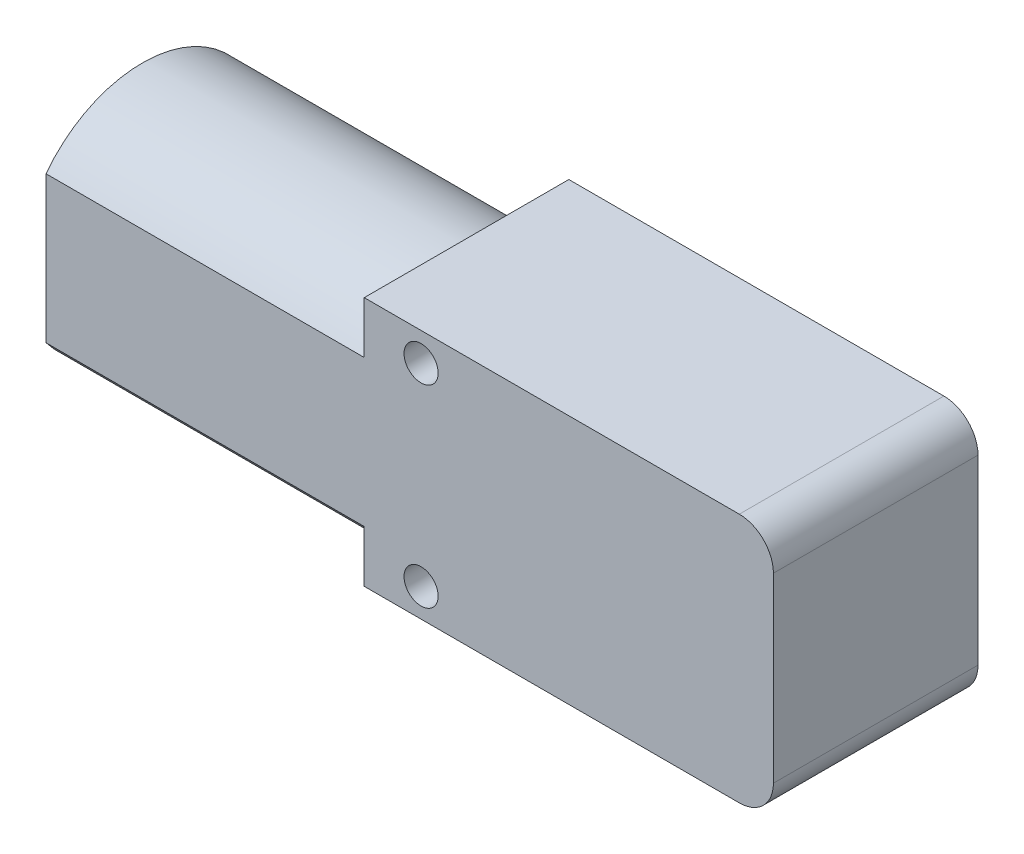
ISO-10303-21;
HEADER;
FILE_DESCRIPTION(('STEP AP214'),'2;1');
FILE_NAME('part.step','',(''),(''),'','','');
FILE_SCHEMA(('AUTOMOTIVE_DESIGN { 1 0 10303 214 1 1 1 1 }'));
ENDSEC;
DATA;
#1=APPLICATION_CONTEXT('core data for automotive mechanical design processes');
#2=APPLICATION_PROTOCOL_DEFINITION('international standard','automotive_design',2000,#1);
#3=PRODUCT_CONTEXT('',#1,'mechanical');
#4=PRODUCT('Part','Part','',(#3));
#5=PRODUCT_RELATED_PRODUCT_CATEGORY('part','',(#4));
#6=PRODUCT_DEFINITION_FORMATION('','',#4);
#7=PRODUCT_DEFINITION_CONTEXT('part definition',#1,'design');
#8=PRODUCT_DEFINITION('design','',#6,#7);
#9=PRODUCT_DEFINITION_SHAPE('','',#8);
#10=(LENGTH_UNIT() NAMED_UNIT(*) SI_UNIT(.MILLI.,.METRE.));
#11=(NAMED_UNIT(*) PLANE_ANGLE_UNIT() SI_UNIT($,.RADIAN.));
#12=(NAMED_UNIT(*) SI_UNIT($,.STERADIAN.) SOLID_ANGLE_UNIT());
#13=UNCERTAINTY_MEASURE_WITH_UNIT(LENGTH_MEASURE(1.E-05),#10,'distance_accuracy_value','');
#14=(GEOMETRIC_REPRESENTATION_CONTEXT(3) GLOBAL_UNCERTAINTY_ASSIGNED_CONTEXT((#13)) GLOBAL_UNIT_ASSIGNED_CONTEXT((#10,
#11,#12)) REPRESENTATION_CONTEXT('',''));
#15=CARTESIAN_POINT('',(0.,0.,0.));
#16=DIRECTION('',(0.,0.,1.));
#17=DIRECTION('',(1.,0.,0.));
#18=AXIS2_PLACEMENT_3D('',#15,#16,#17);
#19=CARTESIAN_POINT('',(0.,0.,18.));
#20=DIRECTION('',(0.,0.,-1.));
#21=DIRECTION('',(-1.,0.,0.));
#22=AXIS2_PLACEMENT_3D('',#19,#20,#21);
#23=PLANE('',#22);
#24=DIRECTION('',(1.,0.,0.));
#25=VECTOR('',#24,1.);
#26=CARTESIAN_POINT('',(18.,-11.,18.));
#27=LINE('',#26,#25);
#28=CARTESIAN_POINT('',(-18.,-11.,18.));
#29=VERTEX_POINT('',#28);
#30=CARTESIAN_POINT('',(15.,-11.,18.));
#31=VERTEX_POINT('',#30);
#32=EDGE_CURVE('E148',#29,#31,#27,.T.);
#33=ORIENTED_EDGE('',*,*,#32,.T.);
#34=CARTESIAN_POINT('',(15.,-8.00000000000001,18.));
#35=DIRECTION('',(0.,0.,-1.));
#36=DIRECTION('',(-1.,0.,0.));
#37=AXIS2_PLACEMENT_3D('',#34,#35,#36);
#38=CIRCLE('',#37,3.);
#39=CARTESIAN_POINT('',(18.,-8.00000000000001,18.));
#40=VERTEX_POINT('',#39);
#41=EDGE_CURVE('E45',#31,#40,#38,.F.);
#42=ORIENTED_EDGE('',*,*,#41,.T.);
#43=DIRECTION('',(0.,1.,0.));
#44=VECTOR('',#43,1.);
#45=CARTESIAN_POINT('',(18.,11.,18.));
#46=LINE('',#45,#44);
#47=CARTESIAN_POINT('',(18.,7.99999999999999,18.));
#48=VERTEX_POINT('',#47);
#49=EDGE_CURVE('E151',#40,#48,#46,.T.);
#50=ORIENTED_EDGE('',*,*,#49,.T.);
#51=CARTESIAN_POINT('',(15.,7.99999999999999,18.));
#52=DIRECTION('',(0.,0.,-1.));
#53=DIRECTION('',(-1.,0.,0.));
#54=AXIS2_PLACEMENT_3D('',#51,#52,#53);
#55=CIRCLE('',#54,3.);
#56=CARTESIAN_POINT('',(15.,11.,18.));
#57=VERTEX_POINT('',#56);
#58=EDGE_CURVE('E180',#48,#57,#55,.F.);
#59=ORIENTED_EDGE('',*,*,#58,.T.);
#60=DIRECTION('',(-1.,0.,0.));
#61=VECTOR('',#60,1.);
#62=CARTESIAN_POINT('',(18.,11.,18.));
#63=LINE('',#62,#61);
#64=CARTESIAN_POINT('',(-18.,11.,18.));
#65=VERTEX_POINT('',#64);
#66=EDGE_CURVE('E154',#57,#65,#63,.T.);
#67=ORIENTED_EDGE('',*,*,#66,.T.);
#68=DIRECTION('',(0.,-1.,0.));
#69=VECTOR('',#68,1.);
#70=CARTESIAN_POINT('',(-18.,11.,18.));
#71=LINE('',#70,#69);
#72=CARTESIAN_POINT('',(-18.,6.43904350909976,18.));
#73=VERTEX_POINT('',#72);
#74=EDGE_CURVE('E145',#65,#73,#71,.T.);
#75=ORIENTED_EDGE('',*,*,#74,.T.);
#76=DIRECTION('',(1.,0.,0.));
#77=VECTOR('',#76,1.);
#78=CARTESIAN_POINT('',(-46.,6.43904350909976,18.));
#79=LINE('',#78,#77);
#80=CARTESIAN_POINT('',(-46.,6.43904350909976,18.));
#81=VERTEX_POINT('',#80);
#82=EDGE_CURVE('E210',#81,#73,#79,.T.);
#83=ORIENTED_EDGE('',*,*,#82,.F.);
#84=DIRECTION('',(0.,1.,0.));
#85=VECTOR('',#84,1.);
#86=CARTESIAN_POINT('',(-46.,6.43904350909976,18.));
#87=LINE('',#86,#85);
#88=CARTESIAN_POINT('',(-46.,-6.43904350909977,18.));
#89=VERTEX_POINT('',#88);
#90=EDGE_CURVE('E128',#89,#81,#87,.T.);
#91=ORIENTED_EDGE('',*,*,#90,.F.);
#92=DIRECTION('',(1.,0.,0.));
#93=VECTOR('',#92,1.);
#94=CARTESIAN_POINT('',(-46.,-6.43904350909977,18.));
#95=LINE('',#94,#93);
#96=CARTESIAN_POINT('',(-18.,-6.43904350909976,18.));
#97=VERTEX_POINT('',#96);
#98=EDGE_CURVE('E141',#89,#97,#95,.T.);
#99=ORIENTED_EDGE('',*,*,#98,.T.);
#100=EDGE_CURVE('E58',#97,#29,#71,.T.);
#101=ORIENTED_EDGE('',*,*,#100,.T.);
#102=EDGE_LOOP('',(#33,#42,#50,#59,#67,#75,#83,#91,#99,#101));
#103=FACE_BOUND('',#102,.T.);
#104=CARTESIAN_POINT('',(-13.,-8.49999999999999,18.));
#105=DIRECTION('',(0.,0.,-1.));
#106=DIRECTION('',(-1.,0.,0.));
#107=AXIS2_PLACEMENT_3D('',#104,#105,#106);
#108=CIRCLE('',#107,1.5);
#109=CARTESIAN_POINT('',(-14.5,-8.49999999999999,18.));
#110=VERTEX_POINT('',#109);
#111=EDGE_CURVE('E229',#110,#110,#108,.F.);
#112=ORIENTED_EDGE('',*,*,#111,.F.);
#113=EDGE_LOOP('',(#112));
#114=FACE_BOUND('',#113,.T.);
#115=CARTESIAN_POINT('',(-13.,8.49999999999999,18.));
#116=DIRECTION('',(0.,0.,-1.));
#117=DIRECTION('',(-1.,0.,0.));
#118=AXIS2_PLACEMENT_3D('',#115,#116,#117);
#119=CIRCLE('',#118,1.5);
#120=CARTESIAN_POINT('',(-14.5,8.49999999999999,18.));
#121=VERTEX_POINT('',#120);
#122=EDGE_CURVE('E223',#121,#121,#119,.T.);
#123=ORIENTED_EDGE('',*,*,#122,.T.);
#124=EDGE_LOOP('',(#123));
#125=FACE_BOUND('',#124,.T.);
#126=ADVANCED_FACE('F37',(#103,#114,#125),#23,.F.);
#127=CARTESIAN_POINT('',(0.,0.,0.));
#128=DIRECTION('',(0.,0.,-1.));
#129=DIRECTION('',(-1.,0.,0.));
#130=AXIS2_PLACEMENT_3D('',#127,#128,#129);
#131=PLANE('',#130);
#132=CARTESIAN_POINT('',(-13.,-8.49999999999999,0.));
#133=DIRECTION('',(0.,0.,-1.));
#134=DIRECTION('',(-1.,0.,0.));
#135=AXIS2_PLACEMENT_3D('',#132,#133,#134);
#136=CIRCLE('',#135,1.5);
#137=CARTESIAN_POINT('',(-14.5,-8.49999999999999,0.));
#138=VERTEX_POINT('',#137);
#139=EDGE_CURVE('E226',#138,#138,#136,.F.);
#140=ORIENTED_EDGE('',*,*,#139,.T.);
#141=EDGE_LOOP('',(#140));
#142=FACE_BOUND('',#141,.T.);
#143=CARTESIAN_POINT('',(6.,0.,0.));
#144=DIRECTION('',(0.,0.,-1.));
#145=DIRECTION('',(-1.,0.,0.));
#146=AXIS2_PLACEMENT_3D('',#143,#144,#145);
#147=CIRCLE('',#146,2.5);
#148=CARTESIAN_POINT('',(3.5,0.,0.));
#149=VERTEX_POINT('',#148);
#150=EDGE_CURVE('E220',#149,#149,#147,.T.);
#151=ORIENTED_EDGE('',*,*,#150,.F.);
#152=EDGE_LOOP('',(#151));
#153=FACE_BOUND('',#152,.T.);
#154=DIRECTION('',(0.,1.,0.));
#155=VECTOR('',#154,1.);
#156=CARTESIAN_POINT('',(18.,11.,0.));
#157=LINE('',#156,#155);
#158=CARTESIAN_POINT('',(18.,-8.00000000000001,0.));
#159=VERTEX_POINT('',#158);
#160=CARTESIAN_POINT('',(18.,7.99999999999999,0.));
#161=VERTEX_POINT('',#160);
#162=EDGE_CURVE('E159',#159,#161,#157,.T.);
#163=ORIENTED_EDGE('',*,*,#162,.F.);
#164=CARTESIAN_POINT('',(15.,-8.00000000000001,0.));
#165=DIRECTION('',(0.,0.,-1.));
#166=DIRECTION('',(-1.,0.,0.));
#167=AXIS2_PLACEMENT_3D('',#164,#165,#166);
#168=CIRCLE('',#167,3.);
#169=CARTESIAN_POINT('',(15.,-11.,0.));
#170=VERTEX_POINT('',#169);
#171=EDGE_CURVE('E176',#159,#170,#168,.T.);
#172=ORIENTED_EDGE('',*,*,#171,.T.);
#173=DIRECTION('',(1.,0.,0.));
#174=VECTOR('',#173,1.);
#175=CARTESIAN_POINT('',(18.,-11.,0.));
#176=LINE('',#175,#174);
#177=CARTESIAN_POINT('',(-18.,-11.,0.));
#178=VERTEX_POINT('',#177);
#179=EDGE_CURVE('E139',#178,#170,#176,.T.);
#180=ORIENTED_EDGE('',*,*,#179,.F.);
#181=DIRECTION('',(0.,-1.,0.));
#182=VECTOR('',#181,1.);
#183=CARTESIAN_POINT('',(-18.,11.,0.));
#184=LINE('',#183,#182);
#185=CARTESIAN_POINT('',(-18.,11.,0.));
#186=VERTEX_POINT('',#185);
#187=EDGE_CURVE('E136',#186,#178,#184,.T.);
#188=ORIENTED_EDGE('',*,*,#187,.F.);
#189=DIRECTION('',(-1.,0.,0.));
#190=VECTOR('',#189,1.);
#191=CARTESIAN_POINT('',(18.,11.,0.));
#192=LINE('',#191,#190);
#193=CARTESIAN_POINT('',(15.,11.,0.));
#194=VERTEX_POINT('',#193);
#195=EDGE_CURVE('E162',#194,#186,#192,.T.);
#196=ORIENTED_EDGE('',*,*,#195,.F.);
#197=CARTESIAN_POINT('',(15.,7.99999999999999,0.));
#198=DIRECTION('',(0.,0.,-1.));
#199=DIRECTION('',(-1.,0.,0.));
#200=AXIS2_PLACEMENT_3D('',#197,#198,#199);
#201=CIRCLE('',#200,3.);
#202=EDGE_CURVE('E174',#194,#161,#201,.T.);
#203=ORIENTED_EDGE('',*,*,#202,.T.);
#204=EDGE_LOOP('',(#163,#172,#180,#188,#196,#203));
#205=FACE_BOUND('',#204,.T.);
#206=CARTESIAN_POINT('',(-13.,8.49999999999999,0.));
#207=DIRECTION('',(0.,0.,-1.));
#208=DIRECTION('',(-1.,0.,0.));
#209=AXIS2_PLACEMENT_3D('',#206,#207,#208);
#210=CIRCLE('',#209,1.5);
#211=CARTESIAN_POINT('',(-14.5,8.49999999999999,0.));
#212=VERTEX_POINT('',#211);
#213=EDGE_CURVE('E232',#212,#212,#210,.T.);
#214=ORIENTED_EDGE('',*,*,#213,.F.);
#215=EDGE_LOOP('',(#214));
#216=FACE_BOUND('',#215,.T.);
#217=ADVANCED_FACE('F196',(#142,#153,#205,#216),#131,.T.);
#218=CARTESIAN_POINT('',(-18.,11.,18.));
#219=DIRECTION('',(1.,0.,0.));
#220=DIRECTION('',(0.,0.,-1.));
#221=AXIS2_PLACEMENT_3D('',#218,#219,#220);
#222=PLANE('',#221);
#223=CARTESIAN_POINT('',(-18.,0.,9.52155397915393));
#224=DIRECTION('',(-1.,0.,0.));
#225=DIRECTION('',(0.,0.,-1.));
#226=AXIS2_PLACEMENT_3D('',#223,#224,#225);
#227=CIRCLE('',#226,10.646376296209);
#228=CARTESIAN_POINT('',(-18.,7.,1.5));
#229=VERTEX_POINT('',#228);
#230=EDGE_CURVE('E135',#73,#229,#227,.T.);
#231=ORIENTED_EDGE('',*,*,#230,.F.);
#232=ORIENTED_EDGE('',*,*,#74,.F.);
#233=DIRECTION('',(0.,0.,-1.));
#234=VECTOR('',#233,1.);
#235=CARTESIAN_POINT('',(-18.,11.,18.));
#236=LINE('',#235,#234);
#237=EDGE_CURVE('E155',#65,#186,#236,.T.);
#238=ORIENTED_EDGE('',*,*,#237,.T.);
#239=ORIENTED_EDGE('',*,*,#187,.T.);
#240=DIRECTION('',(0.,0.,-1.));
#241=VECTOR('',#240,1.);
#242=CARTESIAN_POINT('',(-18.,-11.,18.));
#243=LINE('',#242,#241);
#244=EDGE_CURVE('E166',#29,#178,#243,.T.);
#245=ORIENTED_EDGE('',*,*,#244,.F.);
#246=ORIENTED_EDGE('',*,*,#100,.F.);
#247=CARTESIAN_POINT('',(-18.,0.,9.52155397915393));
#248=DIRECTION('',(-1.,0.,0.));
#249=DIRECTION('',(0.,0.,1.));
#250=AXIS2_PLACEMENT_3D('',#247,#248,#249);
#251=CIRCLE('',#250,10.646376296209);
#252=CARTESIAN_POINT('',(-18.,-7.,1.5));
#253=VERTEX_POINT('',#252);
#254=EDGE_CURVE('E132',#253,#97,#251,.T.);
#255=ORIENTED_EDGE('',*,*,#254,.F.);
#256=DIRECTION('',(0.,-1.,0.));
#257=VECTOR('',#256,1.);
#258=CARTESIAN_POINT('',(-18.,7.,1.5));
#259=LINE('',#258,#257);
#260=EDGE_CURVE('E52',#229,#253,#259,.T.);
#261=ORIENTED_EDGE('',*,*,#260,.F.);
#262=EDGE_LOOP('',(#231,#232,#238,#239,#245,#246,#255,#261));
#263=FACE_BOUND('',#262,.T.);
#264=ADVANCED_FACE('F201',(#263),#222,.F.);
#265=CARTESIAN_POINT('',(18.,-11.,18.));
#266=DIRECTION('',(0.,1.,0.));
#267=DIRECTION('',(-1.,0.,0.));
#268=AXIS2_PLACEMENT_3D('',#265,#266,#267);
#269=PLANE('',#268);
#270=ORIENTED_EDGE('',*,*,#179,.T.);
#271=DIRECTION('',(0.,0.,-1.));
#272=VECTOR('',#271,1.);
#273=CARTESIAN_POINT('',(15.,-11.,18.));
#274=LINE('',#273,#272);
#275=EDGE_CURVE('E178',#170,#31,#274,.F.);
#276=ORIENTED_EDGE('',*,*,#275,.T.);
#277=ORIENTED_EDGE('',*,*,#32,.F.);
#278=ORIENTED_EDGE('',*,*,#244,.T.);
#279=EDGE_LOOP('',(#270,#276,#277,#278));
#280=FACE_BOUND('',#279,.T.);
#281=ADVANCED_FACE('F200',(#280),#269,.F.);
#282=CARTESIAN_POINT('',(18.,11.,18.));
#283=DIRECTION('',(-1.,0.,0.));
#284=DIRECTION('',(0.,0.,1.));
#285=AXIS2_PLACEMENT_3D('',#282,#283,#284);
#286=PLANE('',#285);
#287=ORIENTED_EDGE('',*,*,#49,.F.);
#288=DIRECTION('',(0.,0.,-1.));
#289=VECTOR('',#288,1.);
#290=CARTESIAN_POINT('',(18.,-8.00000000000001,18.));
#291=LINE('',#290,#289);
#292=EDGE_CURVE('E171',#40,#159,#291,.T.);
#293=ORIENTED_EDGE('',*,*,#292,.T.);
#294=ORIENTED_EDGE('',*,*,#162,.T.);
#295=DIRECTION('',(0.,0.,-1.));
#296=VECTOR('',#295,1.);
#297=CARTESIAN_POINT('',(18.,7.99999999999999,18.));
#298=LINE('',#297,#296);
#299=EDGE_CURVE('E169',#161,#48,#298,.F.);
#300=ORIENTED_EDGE('',*,*,#299,.T.);
#301=EDGE_LOOP('',(#287,#293,#294,#300));
#302=FACE_BOUND('',#301,.T.);
#303=ADVANCED_FACE('F191',(#302),#286,.F.);
#304=CARTESIAN_POINT('',(18.,11.,18.));
#305=DIRECTION('',(0.,-1.,0.));
#306=DIRECTION('',(1.,0.,0.));
#307=AXIS2_PLACEMENT_3D('',#304,#305,#306);
#308=PLANE('',#307);
#309=ORIENTED_EDGE('',*,*,#66,.F.);
#310=DIRECTION('',(0.,0.,-1.));
#311=VECTOR('',#310,1.);
#312=CARTESIAN_POINT('',(15.,11.,18.));
#313=LINE('',#312,#311);
#314=EDGE_CURVE('E11',#57,#194,#313,.T.);
#315=ORIENTED_EDGE('',*,*,#314,.T.);
#316=ORIENTED_EDGE('',*,*,#195,.T.);
#317=ORIENTED_EDGE('',*,*,#237,.F.);
#318=EDGE_LOOP('',(#309,#315,#316,#317));
#319=FACE_BOUND('',#318,.T.);
#320=ADVANCED_FACE('F207',(#319),#308,.F.);
#321=CARTESIAN_POINT('',(15.,-8.00000000000001,18.));
#322=DIRECTION('',(0.,0.,-1.));
#323=DIRECTION('',(-1.,0.,0.));
#324=AXIS2_PLACEMENT_3D('',#321,#322,#323);
#325=CYLINDRICAL_SURFACE('',#324,3.);
#326=ORIENTED_EDGE('',*,*,#41,.F.);
#327=ORIENTED_EDGE('',*,*,#275,.F.);
#328=ORIENTED_EDGE('',*,*,#171,.F.);
#329=ORIENTED_EDGE('',*,*,#292,.F.);
#330=EDGE_LOOP('',(#326,#327,#328,#329));
#331=FACE_BOUND('',#330,.T.);
#332=ADVANCED_FACE('F194',(#331),#325,.T.);
#333=CARTESIAN_POINT('',(15.,7.99999999999999,18.));
#334=DIRECTION('',(0.,0.,-1.));
#335=DIRECTION('',(-1.,0.,0.));
#336=AXIS2_PLACEMENT_3D('',#333,#334,#335);
#337=CYLINDRICAL_SURFACE('',#336,3.);
#338=ORIENTED_EDGE('',*,*,#58,.F.);
#339=ORIENTED_EDGE('',*,*,#299,.F.);
#340=ORIENTED_EDGE('',*,*,#202,.F.);
#341=ORIENTED_EDGE('',*,*,#314,.F.);
#342=EDGE_LOOP('',(#338,#339,#340,#341));
#343=FACE_BOUND('',#342,.T.);
#344=ADVANCED_FACE('F39',(#343),#337,.T.);
#345=CARTESIAN_POINT('',(-46.,0.,9.52155397915393));
#346=DIRECTION('',(1.,0.,0.));
#347=DIRECTION('',(0.,0.,-1.));
#348=AXIS2_PLACEMENT_3D('',#345,#346,#347);
#349=CYLINDRICAL_SURFACE('',#348,10.646376296209);
#350=ORIENTED_EDGE('',*,*,#230,.T.);
#351=DIRECTION('',(1.,0.,0.));
#352=VECTOR('',#351,1.);
#353=CARTESIAN_POINT('',(-46.,7.,1.5));
#354=LINE('',#353,#352);
#355=CARTESIAN_POINT('',(-46.,7.,1.5));
#356=VERTEX_POINT('',#355);
#357=EDGE_CURVE('E116',#356,#229,#354,.T.);
#358=ORIENTED_EDGE('',*,*,#357,.F.);
#359=CARTESIAN_POINT('',(-46.,0.,9.52155397915393));
#360=DIRECTION('',(-1.,0.,0.));
#361=DIRECTION('',(0.,0.,-1.));
#362=AXIS2_PLACEMENT_3D('',#359,#360,#361);
#363=CIRCLE('',#362,10.646376296209);
#364=EDGE_CURVE('E123',#81,#356,#363,.T.);
#365=ORIENTED_EDGE('',*,*,#364,.F.);
#366=ORIENTED_EDGE('',*,*,#82,.T.);
#367=EDGE_LOOP('',(#350,#358,#365,#366));
#368=FACE_BOUND('',#367,.T.);
#369=ADVANCED_FACE('F134',(#368),#349,.T.);
#370=CARTESIAN_POINT('',(-46.,7.,1.5));
#371=DIRECTION('',(0.,0.,1.));
#372=DIRECTION('',(1.,0.,0.));
#373=AXIS2_PLACEMENT_3D('',#370,#371,#372);
#374=PLANE('',#373);
#375=ORIENTED_EDGE('',*,*,#260,.T.);
#376=DIRECTION('',(1.,0.,0.));
#377=VECTOR('',#376,1.);
#378=CARTESIAN_POINT('',(-46.,-7.,1.5));
#379=LINE('',#378,#377);
#380=CARTESIAN_POINT('',(-46.,-7.,1.5));
#381=VERTEX_POINT('',#380);
#382=EDGE_CURVE('E119',#381,#253,#379,.T.);
#383=ORIENTED_EDGE('',*,*,#382,.F.);
#384=DIRECTION('',(0.,-1.,0.));
#385=VECTOR('',#384,1.);
#386=CARTESIAN_POINT('',(-46.,7.,1.5));
#387=LINE('',#386,#385);
#388=EDGE_CURVE('E112',#356,#381,#387,.T.);
#389=ORIENTED_EDGE('',*,*,#388,.F.);
#390=ORIENTED_EDGE('',*,*,#357,.T.);
#391=EDGE_LOOP('',(#375,#383,#389,#390));
#392=FACE_BOUND('',#391,.T.);
#393=ADVANCED_FACE('F114',(#392),#374,.F.);
#394=CARTESIAN_POINT('',(-46.,0.,9.52155397915393));
#395=DIRECTION('',(1.,0.,0.));
#396=DIRECTION('',(0.,0.,-1.));
#397=AXIS2_PLACEMENT_3D('',#394,#395,#396);
#398=CYLINDRICAL_SURFACE('',#397,10.646376296209);
#399=ORIENTED_EDGE('',*,*,#254,.T.);
#400=ORIENTED_EDGE('',*,*,#98,.F.);
#401=CARTESIAN_POINT('',(-46.,0.,9.52155397915393));
#402=DIRECTION('',(-1.,0.,0.));
#403=DIRECTION('',(0.,0.,1.));
#404=AXIS2_PLACEMENT_3D('',#401,#402,#403);
#405=CIRCLE('',#404,10.646376296209);
#406=EDGE_CURVE('E122',#381,#89,#405,.T.);
#407=ORIENTED_EDGE('',*,*,#406,.F.);
#408=ORIENTED_EDGE('',*,*,#382,.T.);
#409=EDGE_LOOP('',(#399,#400,#407,#408));
#410=FACE_BOUND('',#409,.T.);
#411=ADVANCED_FACE('F272',(#410),#398,.T.);
#412=CARTESIAN_POINT('',(-46.,0.,9.52155397915393));
#413=DIRECTION('',(1.,0.,0.));
#414=DIRECTION('',(0.,0.,-1.));
#415=AXIS2_PLACEMENT_3D('',#412,#413,#414);
#416=PLANE('',#415);
#417=ORIENTED_EDGE('',*,*,#364,.T.);
#418=ORIENTED_EDGE('',*,*,#388,.T.);
#419=ORIENTED_EDGE('',*,*,#406,.T.);
#420=ORIENTED_EDGE('',*,*,#90,.T.);
#421=EDGE_LOOP('',(#417,#418,#419,#420));
#422=FACE_BOUND('',#421,.T.);
#423=ADVANCED_FACE('F126',(#422),#416,.F.);
#424=CARTESIAN_POINT('',(6.,0.,-8.));
#425=DIRECTION('',(0.,0.,1.));
#426=DIRECTION('',(1.,0.,0.));
#427=AXIS2_PLACEMENT_3D('',#424,#425,#426);
#428=CYLINDRICAL_SURFACE('',#427,2.5);
#429=CARTESIAN_POINT('',(6.,0.,-8.));
#430=DIRECTION('',(0.,0.,-1.));
#431=DIRECTION('',(-1.,0.,0.));
#432=AXIS2_PLACEMENT_3D('',#429,#430,#431);
#433=CIRCLE('',#432,2.5);
#434=CARTESIAN_POINT('',(3.5,0.,-8.));
#435=VERTEX_POINT('',#434);
#436=EDGE_CURVE('E217',#435,#435,#433,.T.);
#437=ORIENTED_EDGE('',*,*,#436,.F.);
#438=EDGE_LOOP('',(#437));
#439=FACE_BOUND('',#438,.T.);
#440=ORIENTED_EDGE('',*,*,#150,.T.);
#441=EDGE_LOOP('',(#440));
#442=FACE_BOUND('',#441,.T.);
#443=ADVANCED_FACE('F280',(#439,#442),#428,.T.);
#444=CARTESIAN_POINT('',(6.,0.,-8.));
#445=DIRECTION('',(0.,0.,-1.));
#446=DIRECTION('',(-1.,0.,0.));
#447=AXIS2_PLACEMENT_3D('',#444,#445,#446);
#448=PLANE('',#447);
#449=ORIENTED_EDGE('',*,*,#436,.T.);
#450=EDGE_LOOP('',(#449));
#451=FACE_BOUND('',#450,.T.);
#452=ADVANCED_FACE('F283',(#451),#448,.T.);
#453=CARTESIAN_POINT('',(-13.,-8.49999999999999,18.));
#454=DIRECTION('',(0.,0.,-1.));
#455=DIRECTION('',(-1.,0.,0.));
#456=AXIS2_PLACEMENT_3D('',#453,#454,#455);
#457=CYLINDRICAL_SURFACE('',#456,1.5);
#458=ORIENTED_EDGE('',*,*,#111,.T.);
#459=EDGE_LOOP('',(#458));
#460=FACE_BOUND('',#459,.T.);
#461=ORIENTED_EDGE('',*,*,#139,.F.);
#462=EDGE_LOOP('',(#461));
#463=FACE_BOUND('',#462,.T.);
#464=ADVANCED_FACE('F242',(#460,#463),#457,.F.);
#465=CARTESIAN_POINT('',(-13.,8.49999999999999,18.));
#466=DIRECTION('',(0.,0.,-1.));
#467=DIRECTION('',(-1.,0.,0.));
#468=AXIS2_PLACEMENT_3D('',#465,#466,#467);
#469=CYLINDRICAL_SURFACE('',#468,1.5);
#470=ORIENTED_EDGE('',*,*,#122,.F.);
#471=EDGE_LOOP('',(#470));
#472=FACE_BOUND('',#471,.T.);
#473=ORIENTED_EDGE('',*,*,#213,.T.);
#474=EDGE_LOOP('',(#473));
#475=FACE_BOUND('',#474,.T.);
#476=ADVANCED_FACE('F239',(#472,#475),#469,.F.);
#477=CLOSED_SHELL('',(#126,#217,#264,#281,#303,#320,#332,#344,#369,#393,#411,#423,#443,#452,
#464,#476));
#478=MANIFOLD_SOLID_BREP('B2',#477);
#479=ADVANCED_BREP_SHAPE_REPRESENTATION('',(#18,#478),#14);
#480=SHAPE_DEFINITION_REPRESENTATION(#9,#479);
ENDSEC;
END-ISO-10303-21;
